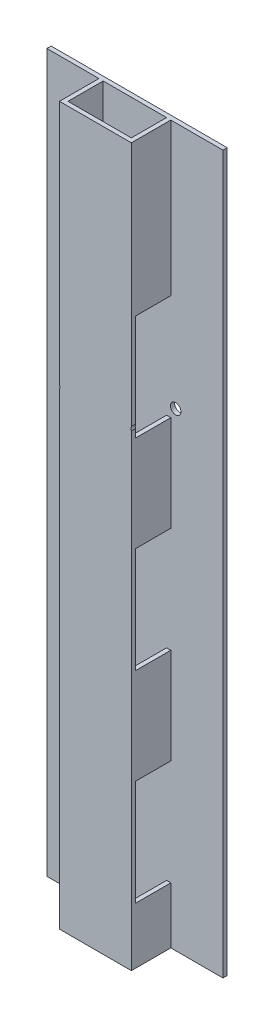
ISO-10303-21;
HEADER;
FILE_DESCRIPTION(('STEP AP214'),'2;1');
FILE_NAME('part.step','',(''),(''),'','','');
FILE_SCHEMA(('AUTOMOTIVE_DESIGN { 1 0 10303 214 1 1 1 1 }'));
ENDSEC;
DATA;
#1=APPLICATION_CONTEXT('core data for automotive mechanical design processes');
#2=APPLICATION_PROTOCOL_DEFINITION('international standard','automotive_design',2000,#1);
#3=PRODUCT_CONTEXT('',#1,'mechanical');
#4=PRODUCT('Part','Part','',(#3));
#5=PRODUCT_RELATED_PRODUCT_CATEGORY('part','',(#4));
#6=PRODUCT_DEFINITION_FORMATION('','',#4);
#7=PRODUCT_DEFINITION_CONTEXT('part definition',#1,'design');
#8=PRODUCT_DEFINITION('design','',#6,#7);
#9=PRODUCT_DEFINITION_SHAPE('','',#8);
#10=(LENGTH_UNIT() NAMED_UNIT(*) SI_UNIT(.MILLI.,.METRE.));
#11=(NAMED_UNIT(*) PLANE_ANGLE_UNIT() SI_UNIT($,.RADIAN.));
#12=(NAMED_UNIT(*) SI_UNIT($,.STERADIAN.) SOLID_ANGLE_UNIT());
#13=UNCERTAINTY_MEASURE_WITH_UNIT(LENGTH_MEASURE(1.E-05),#10,'distance_accuracy_value','');
#14=(GEOMETRIC_REPRESENTATION_CONTEXT(3) GLOBAL_UNCERTAINTY_ASSIGNED_CONTEXT((#13)) GLOBAL_UNIT_ASSIGNED_CONTEXT((#10,
#11,#12)) REPRESENTATION_CONTEXT('',''));
#15=CARTESIAN_POINT('',(0.,0.,0.));
#16=DIRECTION('',(0.,0.,1.));
#17=DIRECTION('',(1.,0.,0.));
#18=AXIS2_PLACEMENT_3D('',#15,#16,#17);
#19=CARTESIAN_POINT('',(25.5,254.5,15.5));
#20=DIRECTION('',(-1.,0.,0.));
#21=DIRECTION('',(0.,0.,1.));
#22=AXIS2_PLACEMENT_3D('',#19,#20,#21);
#23=PLANE('',#22);
#24=DIRECTION('',(0.,0.,1.));
#25=VECTOR('',#24,1.);
#26=CARTESIAN_POINT('',(25.5,77.3474560831854,-15.5));
#27=LINE('',#26,#25);
#28=CARTESIAN_POINT('',(25.5,77.3474560831854,15.5));
#29=VERTEX_POINT('',#28);
#30=CARTESIAN_POINT('',(25.5,77.3474560831854,12.5));
#31=VERTEX_POINT('',#30);
#32=EDGE_CURVE('E46',#29,#31,#27,.F.);
#33=ORIENTED_EDGE('',*,*,#32,.F.);
#34=DIRECTION('',(0.,-1.,0.));
#35=VECTOR('',#34,1.);
#36=CARTESIAN_POINT('',(25.5,254.5,15.5));
#37=LINE('',#36,#35);
#38=CARTESIAN_POINT('',(25.5,-254.5,15.5));
#39=VERTEX_POINT('',#38);
#40=EDGE_CURVE('E302',#29,#39,#37,.T.);
#41=ORIENTED_EDGE('',*,*,#40,.T.);
#42=DIRECTION('',(0.,0.,-1.));
#43=VECTOR('',#42,1.);
#44=CARTESIAN_POINT('',(25.5,-254.5,15.5));
#45=LINE('',#44,#43);
#46=CARTESIAN_POINT('',(25.5,-254.5,-12.5));
#47=VERTEX_POINT('',#46);
#48=EDGE_CURVE('E384',#39,#47,#45,.T.);
#49=ORIENTED_EDGE('',*,*,#48,.T.);
#50=DIRECTION('',(0.,1.,0.));
#51=VECTOR('',#50,1.);
#52=CARTESIAN_POINT('',(25.5,254.5,-12.5));
#53=LINE('',#52,#51);
#54=CARTESIAN_POINT('',(25.5,-214.5,-12.5));
#55=VERTEX_POINT('',#54);
#56=EDGE_CURVE('E347',#47,#55,#53,.T.);
#57=ORIENTED_EDGE('',*,*,#56,.T.);
#58=DIRECTION('',(0.,0.,1.));
#59=VECTOR('',#58,1.);
#60=CARTESIAN_POINT('',(25.5,-214.5,15.5));
#61=LINE('',#60,#59);
#62=CARTESIAN_POINT('',(25.5,-214.5,12.4999999999999));
#63=VERTEX_POINT('',#62);
#64=EDGE_CURVE('E507',#55,#63,#61,.T.);
#65=ORIENTED_EDGE('',*,*,#64,.T.);
#66=DIRECTION('',(0.,1.,0.));
#67=VECTOR('',#66,1.);
#68=CARTESIAN_POINT('',(25.5,254.5,12.4999999999999));
#69=LINE('',#68,#67);
#70=CARTESIAN_POINT('',(25.5,-139.5,12.4999999999999));
#71=VERTEX_POINT('',#70);
#72=EDGE_CURVE('E540',#63,#71,#69,.T.);
#73=ORIENTED_EDGE('',*,*,#72,.T.);
#74=DIRECTION('',(0.,0.,-1.));
#75=VECTOR('',#74,1.);
#76=CARTESIAN_POINT('',(25.5,-139.5,15.5));
#77=LINE('',#76,#75);
#78=CARTESIAN_POINT('',(25.5,-139.5,-12.5));
#79=VERTEX_POINT('',#78);
#80=EDGE_CURVE('E513',#71,#79,#77,.T.);
#81=ORIENTED_EDGE('',*,*,#80,.T.);
#82=CARTESIAN_POINT('',(25.5,-71.5000000000001,-12.5));
#83=VERTEX_POINT('',#82);
#84=EDGE_CURVE('E341',#79,#83,#53,.T.);
#85=ORIENTED_EDGE('',*,*,#84,.T.);
#86=DIRECTION('',(0.,0.,1.));
#87=VECTOR('',#86,1.);
#88=CARTESIAN_POINT('',(25.5,-71.5000000000001,15.5));
#89=LINE('',#88,#87);
#90=CARTESIAN_POINT('',(25.5,-71.5000000000001,12.4999999999999));
#91=VERTEX_POINT('',#90);
#92=EDGE_CURVE('E519',#83,#91,#89,.T.);
#93=ORIENTED_EDGE('',*,*,#92,.T.);
#94=DIRECTION('',(0.,1.,0.));
#95=VECTOR('',#94,1.);
#96=CARTESIAN_POINT('',(25.5,254.5,12.4999999999999));
#97=LINE('',#96,#95);
#98=CARTESIAN_POINT('',(25.5,3.50000000000002,12.4999999999999));
#99=VERTEX_POINT('',#98);
#100=EDGE_CURVE('E543',#91,#99,#97,.T.);
#101=ORIENTED_EDGE('',*,*,#100,.T.);
#102=DIRECTION('',(0.,0.,-1.));
#103=VECTOR('',#102,1.);
#104=CARTESIAN_POINT('',(25.5,3.5,15.5));
#105=LINE('',#104,#103);
#106=CARTESIAN_POINT('',(25.5,3.5,-12.5));
#107=VERTEX_POINT('',#106);
#108=EDGE_CURVE('E525',#99,#107,#105,.T.);
#109=ORIENTED_EDGE('',*,*,#108,.T.);
#110=CARTESIAN_POINT('',(25.5,71.5,-12.5));
#111=VERTEX_POINT('',#110);
#112=EDGE_CURVE('E345',#107,#111,#53,.T.);
#113=ORIENTED_EDGE('',*,*,#112,.T.);
#114=DIRECTION('',(0.,0.,1.));
#115=VECTOR('',#114,1.);
#116=CARTESIAN_POINT('',(25.5,71.5,15.5));
#117=LINE('',#116,#115);
#118=CARTESIAN_POINT('',(25.5,71.5,12.4999999999999));
#119=VERTEX_POINT('',#118);
#120=EDGE_CURVE('E537',#111,#119,#117,.T.);
#121=ORIENTED_EDGE('',*,*,#120,.T.);
#122=DIRECTION('',(0.,1.,0.));
#123=VECTOR('',#122,1.);
#124=CARTESIAN_POINT('',(25.5,254.5,12.4999999999999));
#125=LINE('',#124,#123);
#126=EDGE_CURVE('E547',#119,#31,#125,.T.);
#127=ORIENTED_EDGE('',*,*,#126,.T.);
#128=EDGE_LOOP('',(#33,#41,#49,#57,#65,#73,#81,#85,#93,#101,#109,#113,#121,#127));
#129=FACE_BOUND('',#128,.T.);
#130=ADVANCED_FACE('F32',(#129),#23,.F.);
#131=DIRECTION('',(0.,0.,1.));
#132=VECTOR('',#131,1.);
#133=CARTESIAN_POINT('',(25.5,80.0400384867526,-15.5));
#134=LINE('',#133,#132);
#135=CARTESIAN_POINT('',(25.5,80.0400384867526,12.5));
#136=VERTEX_POINT('',#135);
#137=CARTESIAN_POINT('',(25.5,80.0400384867526,15.5));
#138=VERTEX_POINT('',#137);
#139=EDGE_CURVE('E285',#136,#138,#134,.T.);
#140=ORIENTED_EDGE('',*,*,#139,.F.);
#141=CARTESIAN_POINT('',(25.5,146.5,12.4999999999999));
#142=VERTEX_POINT('',#141);
#143=EDGE_CURVE('E546',#136,#142,#125,.T.);
#144=ORIENTED_EDGE('',*,*,#143,.T.);
#145=DIRECTION('',(0.,0.,-1.));
#146=VECTOR('',#145,1.);
#147=CARTESIAN_POINT('',(25.5,146.5,15.5));
#148=LINE('',#147,#146);
#149=CARTESIAN_POINT('',(25.5,146.5,-12.5));
#150=VERTEX_POINT('',#149);
#151=EDGE_CURVE('E365',#142,#150,#148,.T.);
#152=ORIENTED_EDGE('',*,*,#151,.T.);
#153=CARTESIAN_POINT('',(25.5,254.5,-12.5));
#154=VERTEX_POINT('',#153);
#155=EDGE_CURVE('E317',#150,#154,#53,.T.);
#156=ORIENTED_EDGE('',*,*,#155,.T.);
#157=DIRECTION('',(0.,0.,-1.));
#158=VECTOR('',#157,1.);
#159=CARTESIAN_POINT('',(25.5,254.5,15.5));
#160=LINE('',#159,#158);
#161=CARTESIAN_POINT('',(25.5,254.5,15.5));
#162=VERTEX_POINT('',#161);
#163=EDGE_CURVE('E307',#162,#154,#160,.T.);
#164=ORIENTED_EDGE('',*,*,#163,.F.);
#165=EDGE_CURVE('E299',#162,#138,#37,.T.);
#166=ORIENTED_EDGE('',*,*,#165,.T.);
#167=EDGE_LOOP('',(#140,#144,#152,#156,#164,#166));
#168=FACE_BOUND('',#167,.T.);
#169=ADVANCED_FACE('F304',(#168),#23,.F.);
#170=CARTESIAN_POINT('',(-25.5,254.5,15.5));
#171=DIRECTION('',(1.,0.,0.));
#172=DIRECTION('',(0.,0.,-1.));
#173=AXIS2_PLACEMENT_3D('',#170,#171,#172);
#174=PLANE('',#173);
#175=DIRECTION('',(0.,-1.,0.));
#176=VECTOR('',#175,1.);
#177=CARTESIAN_POINT('',(-25.5,146.5,12.4999999999999));
#178=LINE('',#177,#176);
#179=CARTESIAN_POINT('',(-25.5,146.5,12.4999999999999));
#180=VERTEX_POINT('',#179);
#181=CARTESIAN_POINT('',(-25.5,80.0400384867526,12.5));
#182=VERTEX_POINT('',#181);
#183=EDGE_CURVE('E442',#180,#182,#178,.T.);
#184=ORIENTED_EDGE('',*,*,#183,.T.);
#185=DIRECTION('',(0.,0.,1.));
#186=VECTOR('',#185,1.);
#187=CARTESIAN_POINT('',(-25.5,80.0400384867526,-15.5));
#188=LINE('',#187,#186);
#189=CARTESIAN_POINT('',(-25.5,80.0400384867526,15.5));
#190=VERTEX_POINT('',#189);
#191=EDGE_CURVE('E53',#182,#190,#188,.T.);
#192=ORIENTED_EDGE('',*,*,#191,.T.);
#193=DIRECTION('',(0.,-1.,0.));
#194=VECTOR('',#193,1.);
#195=CARTESIAN_POINT('',(-25.5,254.5,15.5));
#196=LINE('',#195,#194);
#197=CARTESIAN_POINT('',(-25.5,254.5,15.5));
#198=VERTEX_POINT('',#197);
#199=EDGE_CURVE('E310',#198,#190,#196,.T.);
#200=ORIENTED_EDGE('',*,*,#199,.F.);
#201=DIRECTION('',(0.,0.,1.));
#202=VECTOR('',#201,1.);
#203=CARTESIAN_POINT('',(-25.5,254.5,15.5));
#204=LINE('',#203,#202);
#205=CARTESIAN_POINT('',(-25.5,254.5,-12.5));
#206=VERTEX_POINT('',#205);
#207=EDGE_CURVE('E375',#206,#198,#204,.T.);
#208=ORIENTED_EDGE('',*,*,#207,.F.);
#209=DIRECTION('',(0.,-1.,0.));
#210=VECTOR('',#209,1.);
#211=CARTESIAN_POINT('',(-25.5,254.5,-12.5));
#212=LINE('',#211,#210);
#213=CARTESIAN_POINT('',(-25.5,146.5,-12.5));
#214=VERTEX_POINT('',#213);
#215=EDGE_CURVE('E322',#206,#214,#212,.T.);
#216=ORIENTED_EDGE('',*,*,#215,.T.);
#217=DIRECTION('',(0.,0.,1.));
#218=VECTOR('',#217,1.);
#219=CARTESIAN_POINT('',(-25.5,146.5,-12.5));
#220=LINE('',#219,#218);
#221=EDGE_CURVE('E438',#214,#180,#220,.T.);
#222=ORIENTED_EDGE('',*,*,#221,.T.);
#223=EDGE_LOOP('',(#184,#192,#200,#208,#216,#222));
#224=FACE_BOUND('',#223,.T.);
#225=ADVANCED_FACE('F656',(#224),#174,.F.);
#226=CARTESIAN_POINT('',(22.5,254.5,-12.5));
#227=DIRECTION('',(-1.,0.,0.));
#228=DIRECTION('',(0.,0.,1.));
#229=AXIS2_PLACEMENT_3D('',#226,#227,#228);
#230=PLANE('',#229);
#231=DIRECTION('',(0.,0.,1.));
#232=VECTOR('',#231,1.);
#233=CARTESIAN_POINT('',(22.5,71.5,-12.5));
#234=LINE('',#233,#232);
#235=CARTESIAN_POINT('',(22.5,71.5,-12.5));
#236=VERTEX_POINT('',#235);
#237=CARTESIAN_POINT('',(22.5,71.5,12.4999999999999));
#238=VERTEX_POINT('',#237);
#239=EDGE_CURVE('E535',#236,#238,#234,.T.);
#240=ORIENTED_EDGE('',*,*,#239,.F.);
#241=DIRECTION('',(0.,-1.,0.));
#242=VECTOR('',#241,1.);
#243=CARTESIAN_POINT('',(22.5,254.5,-12.5));
#244=LINE('',#243,#242);
#245=CARTESIAN_POINT('',(22.5,3.50000000000002,-12.5000000000001));
#246=VERTEX_POINT('',#245);
#247=EDGE_CURVE('E708',#236,#246,#244,.T.);
#248=ORIENTED_EDGE('',*,*,#247,.T.);
#249=DIRECTION('',(0.,0.,-1.));
#250=VECTOR('',#249,1.);
#251=CARTESIAN_POINT('',(22.5,3.5,-12.5));
#252=LINE('',#251,#250);
#253=CARTESIAN_POINT('',(22.5,3.50000000000002,12.4999999999999));
#254=VERTEX_POINT('',#253);
#255=EDGE_CURVE('E523',#254,#246,#252,.T.);
#256=ORIENTED_EDGE('',*,*,#255,.F.);
#257=DIRECTION('',(0.,-1.,0.));
#258=VECTOR('',#257,1.);
#259=CARTESIAN_POINT('',(22.5,254.5,12.5));
#260=LINE('',#259,#258);
#261=EDGE_CURVE('E576',#238,#254,#260,.T.);
#262=ORIENTED_EDGE('',*,*,#261,.F.);
#263=EDGE_LOOP('',(#240,#248,#256,#262));
#264=FACE_BOUND('',#263,.T.);
#265=ADVANCED_FACE('F660',(#264),#230,.T.);
#266=DIRECTION('',(0.,0.,-1.));
#267=VECTOR('',#266,1.);
#268=CARTESIAN_POINT('',(22.5,146.5,-12.5));
#269=LINE('',#268,#267);
#270=CARTESIAN_POINT('',(22.5,146.5,12.5));
#271=VERTEX_POINT('',#270);
#272=CARTESIAN_POINT('',(22.5,146.5,-12.5));
#273=VERTEX_POINT('',#272);
#274=EDGE_CURVE('E530',#271,#273,#269,.T.);
#275=ORIENTED_EDGE('',*,*,#274,.F.);
#276=CARTESIAN_POINT('',(22.5,254.5,12.5));
#277=VERTEX_POINT('',#276);
#278=EDGE_CURVE('E572',#277,#271,#260,.T.);
#279=ORIENTED_EDGE('',*,*,#278,.F.);
#280=DIRECTION('',(0.,0.,-1.));
#281=VECTOR('',#280,1.);
#282=CARTESIAN_POINT('',(22.5,254.5,-12.5));
#283=LINE('',#282,#281);
#284=CARTESIAN_POINT('',(22.5,254.5,-12.5));
#285=VERTEX_POINT('',#284);
#286=EDGE_CURVE('E551',#277,#285,#283,.T.);
#287=ORIENTED_EDGE('',*,*,#286,.T.);
#288=EDGE_CURVE('E379',#285,#273,#244,.T.);
#289=ORIENTED_EDGE('',*,*,#288,.T.);
#290=EDGE_LOOP('',(#275,#279,#287,#289));
#291=FACE_BOUND('',#290,.T.);
#292=ADVANCED_FACE('F665',(#291),#230,.T.);
#293=DIRECTION('',(0.,0.,1.));
#294=VECTOR('',#293,1.);
#295=CARTESIAN_POINT('',(22.5,-71.5000000000001,-12.5));
#296=LINE('',#295,#294);
#297=CARTESIAN_POINT('',(22.5,-71.5000000000001,-12.5));
#298=VERTEX_POINT('',#297);
#299=CARTESIAN_POINT('',(22.5,-71.5,12.4999999999999));
#300=VERTEX_POINT('',#299);
#301=EDGE_CURVE('E517',#298,#300,#296,.T.);
#302=ORIENTED_EDGE('',*,*,#301,.F.);
#303=CARTESIAN_POINT('',(22.5,-139.5,-12.5000000000001));
#304=VERTEX_POINT('',#303);
#305=EDGE_CURVE('E586',#298,#304,#244,.T.);
#306=ORIENTED_EDGE('',*,*,#305,.T.);
#307=DIRECTION('',(0.,0.,-1.));
#308=VECTOR('',#307,1.);
#309=CARTESIAN_POINT('',(22.5,-139.5,-12.5));
#310=LINE('',#309,#308);
#311=CARTESIAN_POINT('',(22.5,-139.5,12.4999999999999));
#312=VERTEX_POINT('',#311);
#313=EDGE_CURVE('E511',#312,#304,#310,.T.);
#314=ORIENTED_EDGE('',*,*,#313,.F.);
#315=EDGE_CURVE('E1043',#300,#312,#260,.T.);
#316=ORIENTED_EDGE('',*,*,#315,.F.);
#317=EDGE_LOOP('',(#302,#306,#314,#316));
#318=FACE_BOUND('',#317,.T.);
#319=ADVANCED_FACE('F718',(#318),#230,.T.);
#320=CARTESIAN_POINT('',(-22.5,254.5,-12.5));
#321=DIRECTION('',(1.,0.,0.));
#322=DIRECTION('',(0.,0.,-1.));
#323=AXIS2_PLACEMENT_3D('',#320,#321,#322);
#324=PLANE('',#323);
#325=DIRECTION('',(0.,0.,-1.));
#326=VECTOR('',#325,1.);
#327=CARTESIAN_POINT('',(-22.5,71.5,-12.5));
#328=LINE('',#327,#326);
#329=CARTESIAN_POINT('',(-22.5,71.5,12.4999999999999));
#330=VERTEX_POINT('',#329);
#331=CARTESIAN_POINT('',(-22.5,71.5,-12.5));
#332=VERTEX_POINT('',#331);
#333=EDGE_CURVE('E533',#330,#332,#328,.T.);
#334=ORIENTED_EDGE('',*,*,#333,.F.);
#335=DIRECTION('',(0.,-1.,0.));
#336=VECTOR('',#335,1.);
#337=CARTESIAN_POINT('',(-22.5,254.5,12.5));
#338=LINE('',#337,#336);
#339=CARTESIAN_POINT('',(-22.5,3.50000000000002,12.4999999999999));
#340=VERTEX_POINT('',#339);
#341=EDGE_CURVE('E580',#330,#340,#338,.T.);
#342=ORIENTED_EDGE('',*,*,#341,.T.);
#343=DIRECTION('',(0.,0.,1.));
#344=VECTOR('',#343,1.);
#345=CARTESIAN_POINT('',(-22.5,3.5,-12.5));
#346=LINE('',#345,#344);
#347=CARTESIAN_POINT('',(-22.5,3.50000000000002,-12.5000000000001));
#348=VERTEX_POINT('',#347);
#349=EDGE_CURVE('E521',#348,#340,#346,.T.);
#350=ORIENTED_EDGE('',*,*,#349,.F.);
#351=DIRECTION('',(0.,-1.,0.));
#352=VECTOR('',#351,1.);
#353=CARTESIAN_POINT('',(-22.5,254.5,-12.5));
#354=LINE('',#353,#352);
#355=EDGE_CURVE('E584',#332,#348,#354,.T.);
#356=ORIENTED_EDGE('',*,*,#355,.F.);
#357=EDGE_LOOP('',(#334,#342,#350,#356));
#358=FACE_BOUND('',#357,.T.);
#359=ADVANCED_FACE('F627',(#358),#324,.T.);
#360=DIRECTION('',(0.,0.,1.));
#361=VECTOR('',#360,1.);
#362=CARTESIAN_POINT('',(-22.5,146.5,-12.5));
#363=LINE('',#362,#361);
#364=CARTESIAN_POINT('',(-22.5,146.5,-12.5));
#365=VERTEX_POINT('',#364);
#366=CARTESIAN_POINT('',(-22.5,146.5,12.4999999999999));
#367=VERTEX_POINT('',#366);
#368=EDGE_CURVE('E528',#365,#367,#363,.T.);
#369=ORIENTED_EDGE('',*,*,#368,.F.);
#370=CARTESIAN_POINT('',(-22.5,254.5,-12.5));
#371=VERTEX_POINT('',#370);
#372=EDGE_CURVE('E581',#371,#365,#354,.T.);
#373=ORIENTED_EDGE('',*,*,#372,.F.);
#374=DIRECTION('',(0.,0.,1.));
#375=VECTOR('',#374,1.);
#376=CARTESIAN_POINT('',(-22.5,254.5,-12.5));
#377=LINE('',#376,#375);
#378=CARTESIAN_POINT('',(-22.5,254.5,12.5));
#379=VERTEX_POINT('',#378);
#380=EDGE_CURVE('E556',#371,#379,#377,.T.);
#381=ORIENTED_EDGE('',*,*,#380,.T.);
#382=EDGE_CURVE('E577',#379,#367,#338,.T.);
#383=ORIENTED_EDGE('',*,*,#382,.T.);
#384=EDGE_LOOP('',(#369,#373,#381,#383));
#385=FACE_BOUND('',#384,.T.);
#386=ADVANCED_FACE('F695',(#385),#324,.T.);
#387=DIRECTION('',(0.,0.,-1.));
#388=VECTOR('',#387,1.);
#389=CARTESIAN_POINT('',(-22.5,-71.5000000000001,-12.5));
#390=LINE('',#389,#388);
#391=CARTESIAN_POINT('',(-22.5,-71.5000000000001,12.5));
#392=VERTEX_POINT('',#391);
#393=CARTESIAN_POINT('',(-22.5,-71.5,-12.5000000000001));
#394=VERTEX_POINT('',#393);
#395=EDGE_CURVE('E515',#392,#394,#390,.T.);
#396=ORIENTED_EDGE('',*,*,#395,.F.);
#397=CARTESIAN_POINT('',(-22.5,-139.5,12.4999999999999));
#398=VERTEX_POINT('',#397);
#399=EDGE_CURVE('E606',#392,#398,#338,.T.);
#400=ORIENTED_EDGE('',*,*,#399,.T.);
#401=DIRECTION('',(0.,0.,1.));
#402=VECTOR('',#401,1.);
#403=CARTESIAN_POINT('',(-22.5,-139.5,-12.5));
#404=LINE('',#403,#402);
#405=CARTESIAN_POINT('',(-22.5,-139.5,-12.5000000000001));
#406=VERTEX_POINT('',#405);
#407=EDGE_CURVE('E509',#406,#398,#404,.T.);
#408=ORIENTED_EDGE('',*,*,#407,.F.);
#409=EDGE_CURVE('E588',#394,#406,#354,.T.);
#410=ORIENTED_EDGE('',*,*,#409,.F.);
#411=EDGE_LOOP('',(#396,#400,#408,#410));
#412=FACE_BOUND('',#411,.T.);
#413=ADVANCED_FACE('F603',(#412),#324,.T.);
#414=CARTESIAN_POINT('',(0.,254.5,0.));
#415=DIRECTION('',(0.,-1.,0.));
#416=DIRECTION('',(0.,0.,-1.));
#417=AXIS2_PLACEMENT_3D('',#414,#415,#416);
#418=PLANE('',#417);
#419=ORIENTED_EDGE('',*,*,#163,.T.);
#420=DIRECTION('',(1.,0.,0.));
#421=VECTOR('',#420,1.);
#422=CARTESIAN_POINT('',(62.5,254.5,-12.5));
#423=LINE('',#422,#421);
#424=CARTESIAN_POINT('',(62.5,254.5,-12.5));
#425=VERTEX_POINT('',#424);
#426=EDGE_CURVE('E354',#154,#425,#423,.T.);
#427=ORIENTED_EDGE('',*,*,#426,.T.);
#428=DIRECTION('',(0.,0.,-1.));
#429=VECTOR('',#428,1.);
#430=CARTESIAN_POINT('',(62.5,254.5,-12.5));
#431=LINE('',#430,#429);
#432=CARTESIAN_POINT('',(62.5,254.5,-15.5));
#433=VERTEX_POINT('',#432);
#434=EDGE_CURVE('E434',#425,#433,#431,.T.);
#435=ORIENTED_EDGE('',*,*,#434,.T.);
#436=DIRECTION('',(-1.,0.,0.));
#437=VECTOR('',#436,1.);
#438=CARTESIAN_POINT('',(-25.5,254.5,-15.5));
#439=LINE('',#438,#437);
#440=CARTESIAN_POINT('',(-62.5,254.5,-15.5));
#441=VERTEX_POINT('',#440);
#442=EDGE_CURVE('E373',#433,#441,#439,.T.);
#443=ORIENTED_EDGE('',*,*,#442,.T.);
#444=DIRECTION('',(0.,0.,-1.));
#445=VECTOR('',#444,1.);
#446=CARTESIAN_POINT('',(-62.5,254.5,-12.5));
#447=LINE('',#446,#445);
#448=CARTESIAN_POINT('',(-62.5,254.5,-12.5));
#449=VERTEX_POINT('',#448);
#450=EDGE_CURVE('E419',#449,#441,#447,.T.);
#451=ORIENTED_EDGE('',*,*,#450,.F.);
#452=DIRECTION('',(1.,0.,0.));
#453=VECTOR('',#452,1.);
#454=CARTESIAN_POINT('',(-25.5,254.5,-12.5));
#455=LINE('',#454,#453);
#456=EDGE_CURVE('E331',#449,#206,#455,.T.);
#457=ORIENTED_EDGE('',*,*,#456,.T.);
#458=ORIENTED_EDGE('',*,*,#207,.T.);
#459=DIRECTION('',(1.,0.,0.));
#460=VECTOR('',#459,1.);
#461=CARTESIAN_POINT('',(-25.5,254.5,15.5));
#462=LINE('',#461,#460);
#463=EDGE_CURVE('E312',#198,#162,#462,.T.);
#464=ORIENTED_EDGE('',*,*,#463,.T.);
#465=EDGE_LOOP('',(#419,#427,#435,#443,#451,#457,#458,#464));
#466=FACE_BOUND('',#465,.T.);
#467=ORIENTED_EDGE('',*,*,#286,.F.);
#468=DIRECTION('',(1.,0.,0.));
#469=VECTOR('',#468,1.);
#470=CARTESIAN_POINT('',(-22.5,254.5,12.5));
#471=LINE('',#470,#469);
#472=EDGE_CURVE('E559',#379,#277,#471,.T.);
#473=ORIENTED_EDGE('',*,*,#472,.F.);
#474=ORIENTED_EDGE('',*,*,#380,.F.);
#475=DIRECTION('',(-1.,0.,0.));
#476=VECTOR('',#475,1.);
#477=CARTESIAN_POINT('',(-22.5,254.5,-12.5));
#478=LINE('',#477,#476);
#479=EDGE_CURVE('E553',#285,#371,#478,.T.);
#480=ORIENTED_EDGE('',*,*,#479,.F.);
#481=EDGE_LOOP('',(#467,#473,#474,#480));
#482=FACE_BOUND('',#481,.T.);
#483=ADVANCED_FACE('F370',(#466,#482),#418,.F.);
#484=CARTESIAN_POINT('',(0.,-254.5,0.));
#485=DIRECTION('',(0.,-1.,0.));
#486=DIRECTION('',(0.,0.,-1.));
#487=AXIS2_PLACEMENT_3D('',#484,#485,#486);
#488=PLANE('',#487);
#489=ORIENTED_EDGE('',*,*,#48,.F.);
#490=DIRECTION('',(1.,0.,0.));
#491=VECTOR('',#490,1.);
#492=CARTESIAN_POINT('',(-25.5,-254.5,15.5));
#493=LINE('',#492,#491);
#494=CARTESIAN_POINT('',(-25.5,-254.5,15.5));
#495=VERTEX_POINT('',#494);
#496=EDGE_CURVE('E314',#495,#39,#493,.T.);
#497=ORIENTED_EDGE('',*,*,#496,.F.);
#498=DIRECTION('',(0.,0.,1.));
#499=VECTOR('',#498,1.);
#500=CARTESIAN_POINT('',(-25.5,-254.5,15.5));
#501=LINE('',#500,#499);
#502=CARTESIAN_POINT('',(-25.5,-254.5,-12.5));
#503=VERTEX_POINT('',#502);
#504=EDGE_CURVE('E377',#503,#495,#501,.T.);
#505=ORIENTED_EDGE('',*,*,#504,.F.);
#506=DIRECTION('',(-1.,0.,0.));
#507=VECTOR('',#506,1.);
#508=CARTESIAN_POINT('',(-25.5,-254.5,-12.5));
#509=LINE('',#508,#507);
#510=CARTESIAN_POINT('',(-62.5,-254.5,-12.5));
#511=VERTEX_POINT('',#510);
#512=EDGE_CURVE('E330',#503,#511,#509,.T.);
#513=ORIENTED_EDGE('',*,*,#512,.T.);
#514=DIRECTION('',(0.,0.,-1.));
#515=VECTOR('',#514,1.);
#516=CARTESIAN_POINT('',(-62.5,-254.5,-12.5));
#517=LINE('',#516,#515);
#518=CARTESIAN_POINT('',(-62.5,-254.5,-15.5));
#519=VERTEX_POINT('',#518);
#520=EDGE_CURVE('E423',#511,#519,#517,.T.);
#521=ORIENTED_EDGE('',*,*,#520,.T.);
#522=DIRECTION('',(-1.,0.,0.));
#523=VECTOR('',#522,1.);
#524=CARTESIAN_POINT('',(-25.5,-254.5,-15.5));
#525=LINE('',#524,#523);
#526=CARTESIAN_POINT('',(62.5,-254.5,-15.5));
#527=VERTEX_POINT('',#526);
#528=EDGE_CURVE('E386',#527,#519,#525,.T.);
#529=ORIENTED_EDGE('',*,*,#528,.F.);
#530=DIRECTION('',(0.,0.,-1.));
#531=VECTOR('',#530,1.);
#532=CARTESIAN_POINT('',(62.5,-254.5,-12.5));
#533=LINE('',#532,#531);
#534=CARTESIAN_POINT('',(62.5,-254.5,-12.5));
#535=VERTEX_POINT('',#534);
#536=EDGE_CURVE('E360',#535,#527,#533,.T.);
#537=ORIENTED_EDGE('',*,*,#536,.F.);
#538=DIRECTION('',(-1.,0.,0.));
#539=VECTOR('',#538,1.);
#540=CARTESIAN_POINT('',(62.5,-254.5,-12.5));
#541=LINE('',#540,#539);
#542=EDGE_CURVE('E355',#535,#47,#541,.T.);
#543=ORIENTED_EDGE('',*,*,#542,.T.);
#544=EDGE_LOOP('',(#489,#497,#505,#513,#521,#529,#537,#543));
#545=FACE_BOUND('',#544,.T.);
#546=DIRECTION('',(1.,0.,0.));
#547=VECTOR('',#546,1.);
#548=CARTESIAN_POINT('',(-22.5,-254.5,12.5));
#549=LINE('',#548,#547);
#550=CARTESIAN_POINT('',(-22.5,-254.5,12.5));
#551=VERTEX_POINT('',#550);
#552=CARTESIAN_POINT('',(22.5,-254.5,12.5));
#553=VERTEX_POINT('',#552);
#554=EDGE_CURVE('E554',#551,#553,#549,.T.);
#555=ORIENTED_EDGE('',*,*,#554,.T.);
#556=DIRECTION('',(0.,0.,-1.));
#557=VECTOR('',#556,1.);
#558=CARTESIAN_POINT('',(22.5,-254.5,-12.5));
#559=LINE('',#558,#557);
#560=CARTESIAN_POINT('',(22.5,-254.5,-12.5));
#561=VERTEX_POINT('',#560);
#562=EDGE_CURVE('E550',#553,#561,#559,.T.);
#563=ORIENTED_EDGE('',*,*,#562,.T.);
#564=DIRECTION('',(-1.,0.,0.));
#565=VECTOR('',#564,1.);
#566=CARTESIAN_POINT('',(-22.5,-254.5,-12.5));
#567=LINE('',#566,#565);
#568=CARTESIAN_POINT('',(-22.5,-254.5,-12.5));
#569=VERTEX_POINT('',#568);
#570=EDGE_CURVE('E564',#561,#569,#567,.T.);
#571=ORIENTED_EDGE('',*,*,#570,.T.);
#572=DIRECTION('',(0.,0.,1.));
#573=VECTOR('',#572,1.);
#574=CARTESIAN_POINT('',(-22.5,-254.5,-12.5));
#575=LINE('',#574,#573);
#576=EDGE_CURVE('E567',#569,#551,#575,.T.);
#577=ORIENTED_EDGE('',*,*,#576,.T.);
#578=EDGE_LOOP('',(#555,#563,#571,#577));
#579=FACE_BOUND('',#578,.T.);
#580=ADVANCED_FACE('F392',(#545,#579),#488,.T.);
#581=CARTESIAN_POINT('',(-25.5,254.5,-15.5));
#582=DIRECTION('',(0.,0.,1.));
#583=DIRECTION('',(1.,0.,0.));
#584=AXIS2_PLACEMENT_3D('',#581,#582,#583);
#585=PLANE('',#584);
#586=CARTESIAN_POINT('',(29.,78.693747284969,-15.5));
#587=DIRECTION('',(0.,0.,-1.));
#588=DIRECTION('',(-1.,0.,0.));
#589=AXIS2_PLACEMENT_3D('',#586,#587,#588);
#590=CIRCLE('',#589,3.75);
#591=CARTESIAN_POINT('',(25.25,78.693747284969,-15.5));
#592=VERTEX_POINT('',#591);
#593=EDGE_CURVE('E292',#592,#592,#590,.T.);
#594=ORIENTED_EDGE('',*,*,#593,.F.);
#595=EDGE_LOOP('',(#594));
#596=FACE_BOUND('',#595,.T.);
#597=CARTESIAN_POINT('',(-29.,78.693747284969,-15.5));
#598=DIRECTION('',(0.,0.,1.));
#599=DIRECTION('',(1.,0.,0.));
#600=AXIS2_PLACEMENT_3D('',#597,#598,#599);
#601=CIRCLE('',#600,3.75);
#602=CARTESIAN_POINT('',(-25.25,78.693747284969,-15.5));
#603=VERTEX_POINT('',#602);
#604=EDGE_CURVE('E397',#603,#603,#601,.T.);
#605=ORIENTED_EDGE('',*,*,#604,.T.);
#606=EDGE_LOOP('',(#605));
#607=FACE_BOUND('',#606,.T.);
#608=ORIENTED_EDGE('',*,*,#528,.T.);
#609=DIRECTION('',(0.,1.,0.));
#610=VECTOR('',#609,1.);
#611=CARTESIAN_POINT('',(-62.5,-254.5,-15.5));
#612=LINE('',#611,#610);
#613=EDGE_CURVE('E339',#519,#441,#612,.T.);
#614=ORIENTED_EDGE('',*,*,#613,.T.);
#615=ORIENTED_EDGE('',*,*,#442,.F.);
#616=DIRECTION('',(0.,-1.,0.));
#617=VECTOR('',#616,1.);
#618=CARTESIAN_POINT('',(62.5,-254.5,-15.5));
#619=LINE('',#618,#617);
#620=EDGE_CURVE('E422',#433,#527,#619,.T.);
#621=ORIENTED_EDGE('',*,*,#620,.T.);
#622=EDGE_LOOP('',(#608,#614,#615,#621));
#623=FACE_BOUND('',#622,.T.);
#624=ADVANCED_FACE('F670',(#596,#607,#623),#585,.F.);
#625=CARTESIAN_POINT('',(-25.5,77.3474560831854,15.5));
#626=VERTEX_POINT('',#625);
#627=EDGE_CURVE('E308',#626,#495,#196,.T.);
#628=ORIENTED_EDGE('',*,*,#627,.F.);
#629=DIRECTION('',(0.,0.,1.));
#630=VECTOR('',#629,1.);
#631=CARTESIAN_POINT('',(-25.5,77.3474560831854,-15.5));
#632=LINE('',#631,#630);
#633=CARTESIAN_POINT('',(-25.5,77.3474560831854,12.5));
#634=VERTEX_POINT('',#633);
#635=EDGE_CURVE('E401',#626,#634,#632,.F.);
#636=ORIENTED_EDGE('',*,*,#635,.T.);
#637=CARTESIAN_POINT('',(-25.5,71.5,12.4999999999999));
#638=VERTEX_POINT('',#637);
#639=EDGE_CURVE('E440',#634,#638,#178,.T.);
#640=ORIENTED_EDGE('',*,*,#639,.T.);
#641=DIRECTION('',(0.,0.,-1.));
#642=VECTOR('',#641,1.);
#643=CARTESIAN_POINT('',(-25.5,71.5,-12.5));
#644=LINE('',#643,#642);
#645=CARTESIAN_POINT('',(-25.5,71.5,-12.5));
#646=VERTEX_POINT('',#645);
#647=EDGE_CURVE('E445',#638,#646,#644,.T.);
#648=ORIENTED_EDGE('',*,*,#647,.T.);
#649=CARTESIAN_POINT('',(-25.5,3.5,-12.5));
#650=VERTEX_POINT('',#649);
#651=EDGE_CURVE('E318',#646,#650,#212,.T.);
#652=ORIENTED_EDGE('',*,*,#651,.T.);
#653=DIRECTION('',(0.,0.,1.));
#654=VECTOR('',#653,1.);
#655=CARTESIAN_POINT('',(-25.5,3.50000000000002,12.4999999999999));
#656=LINE('',#655,#654);
#657=CARTESIAN_POINT('',(-25.5,3.50000000000002,12.4999999999999));
#658=VERTEX_POINT('',#657);
#659=EDGE_CURVE('E469',#650,#658,#656,.T.);
#660=ORIENTED_EDGE('',*,*,#659,.T.);
#661=DIRECTION('',(0.,-1.,0.));
#662=VECTOR('',#661,1.);
#663=CARTESIAN_POINT('',(-25.5,3.50000000000002,12.4999999999999));
#664=LINE('',#663,#662);
#665=CARTESIAN_POINT('',(-25.5,-71.5,12.4999999999999));
#666=VERTEX_POINT('',#665);
#667=EDGE_CURVE('E462',#658,#666,#664,.T.);
#668=ORIENTED_EDGE('',*,*,#667,.T.);
#669=DIRECTION('',(0.,0.,-1.));
#670=VECTOR('',#669,1.);
#671=CARTESIAN_POINT('',(-25.5,-71.5,12.4999999999999));
#672=LINE('',#671,#670);
#673=CARTESIAN_POINT('',(-25.5,-71.5000000000001,-12.5));
#674=VERTEX_POINT('',#673);
#675=EDGE_CURVE('E465',#666,#674,#672,.T.);
#676=ORIENTED_EDGE('',*,*,#675,.T.);
#677=CARTESIAN_POINT('',(-25.5,-139.5,-12.5));
#678=VERTEX_POINT('',#677);
#679=EDGE_CURVE('E320',#674,#678,#212,.T.);
#680=ORIENTED_EDGE('',*,*,#679,.T.);
#681=DIRECTION('',(0.,0.,1.));
#682=VECTOR('',#681,1.);
#683=CARTESIAN_POINT('',(-25.5,-139.5,12.4999999999999));
#684=LINE('',#683,#682);
#685=CARTESIAN_POINT('',(-25.5,-139.5,12.4999999999999));
#686=VERTEX_POINT('',#685);
#687=EDGE_CURVE('E488',#678,#686,#684,.T.);
#688=ORIENTED_EDGE('',*,*,#687,.T.);
#689=DIRECTION('',(0.,-1.,0.));
#690=VECTOR('',#689,1.);
#691=CARTESIAN_POINT('',(-25.5,-139.5,12.4999999999999));
#692=LINE('',#691,#690);
#693=CARTESIAN_POINT('',(-25.5,-214.5,12.4999999999999));
#694=VERTEX_POINT('',#693);
#695=EDGE_CURVE('E436',#686,#694,#692,.T.);
#696=ORIENTED_EDGE('',*,*,#695,.T.);
#697=DIRECTION('',(0.,0.,-1.));
#698=VECTOR('',#697,1.);
#699=CARTESIAN_POINT('',(-25.5,-214.5,12.4999999999999));
#700=LINE('',#699,#698);
#701=CARTESIAN_POINT('',(-25.5,-214.5,-12.5));
#702=VERTEX_POINT('',#701);
#703=EDGE_CURVE('E486',#694,#702,#700,.T.);
#704=ORIENTED_EDGE('',*,*,#703,.T.);
#705=EDGE_CURVE('E327',#702,#503,#212,.T.);
#706=ORIENTED_EDGE('',*,*,#705,.T.);
#707=ORIENTED_EDGE('',*,*,#504,.T.);
#708=EDGE_LOOP('',(#628,#636,#640,#648,#652,#660,#668,#676,#680,#688,#696,#704,#706,#707));
#709=FACE_BOUND('',#708,.T.);
#710=ADVANCED_FACE('F389',(#709),#174,.F.);
#711=CARTESIAN_POINT('',(-25.5,254.5,15.5));
#712=DIRECTION('',(0.,0.,-1.));
#713=DIRECTION('',(-1.,0.,0.));
#714=AXIS2_PLACEMENT_3D('',#711,#712,#713);
#715=PLANE('',#714);
#716=CARTESIAN_POINT('',(29.,78.693747284969,15.5));
#717=DIRECTION('',(0.,0.,-1.));
#718=DIRECTION('',(-1.,0.,0.));
#719=AXIS2_PLACEMENT_3D('',#716,#717,#718);
#720=CIRCLE('',#719,3.75);
#721=EDGE_CURVE('E288',#29,#138,#720,.T.);
#722=ORIENTED_EDGE('',*,*,#721,.T.);
#723=ORIENTED_EDGE('',*,*,#165,.F.);
#724=ORIENTED_EDGE('',*,*,#463,.F.);
#725=ORIENTED_EDGE('',*,*,#199,.T.);
#726=CARTESIAN_POINT('',(-29.,78.693747284969,15.5));
#727=DIRECTION('',(0.,0.,1.));
#728=DIRECTION('',(1.,0.,0.));
#729=AXIS2_PLACEMENT_3D('',#726,#727,#728);
#730=CIRCLE('',#729,3.75);
#731=EDGE_CURVE('E395',#626,#190,#730,.T.);
#732=ORIENTED_EDGE('',*,*,#731,.F.);
#733=ORIENTED_EDGE('',*,*,#627,.T.);
#734=ORIENTED_EDGE('',*,*,#496,.T.);
#735=ORIENTED_EDGE('',*,*,#40,.F.);
#736=EDGE_LOOP('',(#722,#723,#724,#725,#732,#733,#734,#735));
#737=FACE_BOUND('',#736,.T.);
#738=ADVANCED_FACE('F297',(#737),#715,.F.);
#739=DIRECTION('',(0.,0.,1.));
#740=VECTOR('',#739,1.);
#741=CARTESIAN_POINT('',(22.5,-214.5,-12.5));
#742=LINE('',#741,#740);
#743=CARTESIAN_POINT('',(22.5,-214.5,-12.5));
#744=VERTEX_POINT('',#743);
#745=CARTESIAN_POINT('',(22.5,-214.5,12.4999999999999));
#746=VERTEX_POINT('',#745);
#747=EDGE_CURVE('E505',#744,#746,#742,.T.);
#748=ORIENTED_EDGE('',*,*,#747,.F.);
#749=EDGE_CURVE('E583',#744,#561,#244,.T.);
#750=ORIENTED_EDGE('',*,*,#749,.T.);
#751=ORIENTED_EDGE('',*,*,#562,.F.);
#752=EDGE_CURVE('E561',#746,#553,#260,.T.);
#753=ORIENTED_EDGE('',*,*,#752,.F.);
#754=EDGE_LOOP('',(#748,#750,#751,#753));
#755=FACE_BOUND('',#754,.T.);
#756=ADVANCED_FACE('F646',(#755),#230,.T.);
#757=CARTESIAN_POINT('',(-22.5,254.5,-12.5));
#758=DIRECTION('',(0.,0.,1.));
#759=DIRECTION('',(1.,0.,0.));
#760=AXIS2_PLACEMENT_3D('',#757,#758,#759);
#761=PLANE('',#760);
#762=CARTESIAN_POINT('',(29.,78.693747284969,-12.5));
#763=DIRECTION('',(0.,0.,1.));
#764=DIRECTION('',(1.,0.,0.));
#765=AXIS2_PLACEMENT_3D('',#762,#763,#764);
#766=CIRCLE('',#765,3.75);
#767=CARTESIAN_POINT('',(32.75,78.693747284969,-12.5));
#768=VERTEX_POINT('',#767);
#769=EDGE_CURVE('E398',#768,#768,#766,.F.);
#770=ORIENTED_EDGE('',*,*,#769,.T.);
#771=EDGE_LOOP('',(#770));
#772=FACE_BOUND('',#771,.T.);
#773=CARTESIAN_POINT('',(-29.,78.693747284969,-12.5));
#774=DIRECTION('',(0.,0.,1.));
#775=DIRECTION('',(1.,0.,0.));
#776=AXIS2_PLACEMENT_3D('',#773,#774,#775);
#777=CIRCLE('',#776,3.75);
#778=CARTESIAN_POINT('',(-25.25,78.693747284969,-12.5));
#779=VERTEX_POINT('',#778);
#780=EDGE_CURVE('E409',#779,#779,#777,.T.);
#781=ORIENTED_EDGE('',*,*,#780,.F.);
#782=EDGE_LOOP('',(#781));
#783=FACE_BOUND('',#782,.T.);
#784=DIRECTION('',(1.,0.,0.));
#785=VECTOR('',#784,1.);
#786=CARTESIAN_POINT('',(-25.5,146.5,-12.5));
#787=LINE('',#786,#785);
#788=EDGE_CURVE('E460',#214,#365,#787,.T.);
#789=ORIENTED_EDGE('',*,*,#788,.F.);
#790=ORIENTED_EDGE('',*,*,#215,.F.);
#791=ORIENTED_EDGE('',*,*,#456,.F.);
#792=DIRECTION('',(0.,1.,0.));
#793=VECTOR('',#792,1.);
#794=CARTESIAN_POINT('',(-62.5,-254.5,-12.5));
#795=LINE('',#794,#793);
#796=EDGE_CURVE('E337',#511,#449,#795,.T.);
#797=ORIENTED_EDGE('',*,*,#796,.F.);
#798=ORIENTED_EDGE('',*,*,#512,.F.);
#799=ORIENTED_EDGE('',*,*,#705,.F.);
#800=DIRECTION('',(1.,0.,0.));
#801=VECTOR('',#800,1.);
#802=CARTESIAN_POINT('',(-25.5,-214.5,-12.5000000000001));
#803=LINE('',#802,#801);
#804=CARTESIAN_POINT('',(-22.5,-214.5,-12.5000000000001));
#805=VERTEX_POINT('',#804);
#806=EDGE_CURVE('E498',#702,#805,#803,.T.);
#807=ORIENTED_EDGE('',*,*,#806,.T.);
#808=EDGE_CURVE('E579',#805,#569,#354,.T.);
#809=ORIENTED_EDGE('',*,*,#808,.T.);
#810=ORIENTED_EDGE('',*,*,#570,.F.);
#811=ORIENTED_EDGE('',*,*,#749,.F.);
#812=EDGE_CURVE('E501',#744,#55,#803,.T.);
#813=ORIENTED_EDGE('',*,*,#812,.T.);
#814=ORIENTED_EDGE('',*,*,#56,.F.);
#815=ORIENTED_EDGE('',*,*,#542,.F.);
#816=DIRECTION('',(0.,-1.,0.));
#817=VECTOR('',#816,1.);
#818=CARTESIAN_POINT('',(62.5,-254.5,-12.5));
#819=LINE('',#818,#817);
#820=EDGE_CURVE('E362',#425,#535,#819,.T.);
#821=ORIENTED_EDGE('',*,*,#820,.F.);
#822=ORIENTED_EDGE('',*,*,#426,.F.);
#823=ORIENTED_EDGE('',*,*,#155,.F.);
#824=EDGE_CURVE('E447',#273,#150,#787,.T.);
#825=ORIENTED_EDGE('',*,*,#824,.F.);
#826=ORIENTED_EDGE('',*,*,#288,.F.);
#827=ORIENTED_EDGE('',*,*,#479,.T.);
#828=ORIENTED_EDGE('',*,*,#372,.T.);
#829=EDGE_LOOP('',(#789,#790,#791,#797,#798,#799,#807,#809,#810,#811,#813,#814,#815,#821,#822,
#823,#825,#826,#827,#828));
#830=FACE_BOUND('',#829,.T.);
#831=DIRECTION('',(1.,0.,0.));
#832=VECTOR('',#831,1.);
#833=CARTESIAN_POINT('',(-25.5,3.50000000000002,-12.5000000000001));
#834=LINE('',#833,#832);
#835=EDGE_CURVE('E475',#650,#348,#834,.T.);
#836=ORIENTED_EDGE('',*,*,#835,.F.);
#837=ORIENTED_EDGE('',*,*,#651,.F.);
#838=DIRECTION('',(1.,0.,0.));
#839=VECTOR('',#838,1.);
#840=CARTESIAN_POINT('',(-25.5,71.5,-12.5));
#841=LINE('',#840,#839);
#842=EDGE_CURVE('E448',#646,#332,#841,.T.);
#843=ORIENTED_EDGE('',*,*,#842,.T.);
#844=ORIENTED_EDGE('',*,*,#355,.T.);
#845=EDGE_LOOP('',(#836,#837,#843,#844));
#846=FACE_BOUND('',#845,.T.);
#847=ORIENTED_EDGE('',*,*,#679,.F.);
#848=DIRECTION('',(1.,0.,0.));
#849=VECTOR('',#848,1.);
#850=CARTESIAN_POINT('',(-25.5,-71.5,-12.5000000000001));
#851=LINE('',#850,#849);
#852=EDGE_CURVE('E478',#674,#394,#851,.T.);
#853=ORIENTED_EDGE('',*,*,#852,.T.);
#854=ORIENTED_EDGE('',*,*,#409,.T.);
#855=DIRECTION('',(1.,0.,0.));
#856=VECTOR('',#855,1.);
#857=CARTESIAN_POINT('',(-25.5,-139.5,-12.5000000000001));
#858=LINE('',#857,#856);
#859=EDGE_CURVE('E495',#678,#406,#858,.T.);
#860=ORIENTED_EDGE('',*,*,#859,.F.);
#861=EDGE_LOOP('',(#847,#853,#854,#860));
#862=FACE_BOUND('',#861,.T.);
#863=EDGE_CURVE('E481',#298,#83,#851,.T.);
#864=ORIENTED_EDGE('',*,*,#863,.T.);
#865=ORIENTED_EDGE('',*,*,#84,.F.);
#866=EDGE_CURVE('E497',#304,#79,#858,.T.);
#867=ORIENTED_EDGE('',*,*,#866,.F.);
#868=ORIENTED_EDGE('',*,*,#305,.F.);
#869=EDGE_LOOP('',(#864,#865,#867,#868));
#870=FACE_BOUND('',#869,.T.);
#871=ORIENTED_EDGE('',*,*,#112,.F.);
#872=EDGE_CURVE('E477',#246,#107,#834,.T.);
#873=ORIENTED_EDGE('',*,*,#872,.F.);
#874=ORIENTED_EDGE('',*,*,#247,.F.);
#875=EDGE_CURVE('E452',#236,#111,#841,.T.);
#876=ORIENTED_EDGE('',*,*,#875,.T.);
#877=EDGE_LOOP('',(#871,#873,#874,#876));
#878=FACE_BOUND('',#877,.T.);
#879=ADVANCED_FACE('F596',(#772,#783,#830,#846,#862,#870,#878),#761,.T.);
#880=DIRECTION('',(0.,0.,-1.));
#881=VECTOR('',#880,1.);
#882=CARTESIAN_POINT('',(-22.5,-214.5,-12.5));
#883=LINE('',#882,#881);
#884=CARTESIAN_POINT('',(-22.5,-214.5,12.5));
#885=VERTEX_POINT('',#884);
#886=EDGE_CURVE('E451',#885,#805,#883,.T.);
#887=ORIENTED_EDGE('',*,*,#886,.F.);
#888=EDGE_CURVE('E575',#885,#551,#338,.T.);
#889=ORIENTED_EDGE('',*,*,#888,.T.);
#890=ORIENTED_EDGE('',*,*,#576,.F.);
#891=ORIENTED_EDGE('',*,*,#808,.F.);
#892=EDGE_LOOP('',(#887,#889,#890,#891));
#893=FACE_BOUND('',#892,.T.);
#894=ADVANCED_FACE('F638',(#893),#324,.T.);
#895=CARTESIAN_POINT('',(-22.5,254.5,12.5));
#896=DIRECTION('',(0.,0.,-1.));
#897=DIRECTION('',(-1.,0.,0.));
#898=AXIS2_PLACEMENT_3D('',#895,#896,#897);
#899=PLANE('',#898);
#900=ORIENTED_EDGE('',*,*,#143,.F.);
#901=CARTESIAN_POINT('',(29.,78.693747284969,12.5));
#902=DIRECTION('',(0.,0.,-1.));
#903=DIRECTION('',(-1.,0.,0.));
#904=AXIS2_PLACEMENT_3D('',#901,#902,#903);
#905=CIRCLE('',#904,3.75);
#906=EDGE_CURVE('E11',#136,#31,#905,.F.);
#907=ORIENTED_EDGE('',*,*,#906,.T.);
#908=ORIENTED_EDGE('',*,*,#126,.F.);
#909=DIRECTION('',(1.,0.,0.));
#910=VECTOR('',#909,1.);
#911=CARTESIAN_POINT('',(-25.5,71.5,12.4999999999999));
#912=LINE('',#911,#910);
#913=EDGE_CURVE('E455',#238,#119,#912,.T.);
#914=ORIENTED_EDGE('',*,*,#913,.F.);
#915=ORIENTED_EDGE('',*,*,#261,.T.);
#916=DIRECTION('',(1.,0.,0.));
#917=VECTOR('',#916,1.);
#918=CARTESIAN_POINT('',(-25.5,3.50000000000002,12.4999999999999));
#919=LINE('',#918,#917);
#920=EDGE_CURVE('E474',#254,#99,#919,.T.);
#921=ORIENTED_EDGE('',*,*,#920,.T.);
#922=ORIENTED_EDGE('',*,*,#100,.F.);
#923=DIRECTION('',(1.,0.,0.));
#924=VECTOR('',#923,1.);
#925=CARTESIAN_POINT('',(-25.5,-71.5,12.4999999999999));
#926=LINE('',#925,#924);
#927=EDGE_CURVE('E471',#300,#91,#926,.T.);
#928=ORIENTED_EDGE('',*,*,#927,.F.);
#929=ORIENTED_EDGE('',*,*,#315,.T.);
#930=DIRECTION('',(1.,0.,0.));
#931=VECTOR('',#930,1.);
#932=CARTESIAN_POINT('',(-25.5,-139.5,12.4999999999999));
#933=LINE('',#932,#931);
#934=EDGE_CURVE('E494',#312,#71,#933,.T.);
#935=ORIENTED_EDGE('',*,*,#934,.T.);
#936=ORIENTED_EDGE('',*,*,#72,.F.);
#937=DIRECTION('',(1.,0.,0.));
#938=VECTOR('',#937,1.);
#939=CARTESIAN_POINT('',(-25.5,-214.5,12.4999999999999));
#940=LINE('',#939,#938);
#941=EDGE_CURVE('E491',#746,#63,#940,.T.);
#942=ORIENTED_EDGE('',*,*,#941,.F.);
#943=ORIENTED_EDGE('',*,*,#752,.T.);
#944=ORIENTED_EDGE('',*,*,#554,.F.);
#945=ORIENTED_EDGE('',*,*,#888,.F.);
#946=EDGE_CURVE('E502',#694,#885,#940,.T.);
#947=ORIENTED_EDGE('',*,*,#946,.F.);
#948=ORIENTED_EDGE('',*,*,#695,.F.);
#949=EDGE_CURVE('E466',#686,#398,#933,.T.);
#950=ORIENTED_EDGE('',*,*,#949,.T.);
#951=ORIENTED_EDGE('',*,*,#399,.F.);
#952=EDGE_CURVE('E482',#666,#392,#926,.T.);
#953=ORIENTED_EDGE('',*,*,#952,.F.);
#954=ORIENTED_EDGE('',*,*,#667,.F.);
#955=EDGE_CURVE('E441',#658,#340,#919,.T.);
#956=ORIENTED_EDGE('',*,*,#955,.T.);
#957=ORIENTED_EDGE('',*,*,#341,.F.);
#958=EDGE_CURVE('E453',#638,#330,#912,.T.);
#959=ORIENTED_EDGE('',*,*,#958,.F.);
#960=ORIENTED_EDGE('',*,*,#639,.F.);
#961=CARTESIAN_POINT('',(-29.,78.693747284969,12.5));
#962=DIRECTION('',(0.,0.,-1.));
#963=DIRECTION('',(-1.,0.,0.));
#964=AXIS2_PLACEMENT_3D('',#961,#962,#963);
#965=CIRCLE('',#964,3.75);
#966=EDGE_CURVE('E39',#182,#634,#965,.T.);
#967=ORIENTED_EDGE('',*,*,#966,.F.);
#968=ORIENTED_EDGE('',*,*,#183,.F.);
#969=DIRECTION('',(1.,0.,0.));
#970=VECTOR('',#969,1.);
#971=CARTESIAN_POINT('',(-25.5,146.5,12.4999999999999));
#972=LINE('',#971,#970);
#973=EDGE_CURVE('E456',#180,#367,#972,.T.);
#974=ORIENTED_EDGE('',*,*,#973,.T.);
#975=ORIENTED_EDGE('',*,*,#382,.F.);
#976=ORIENTED_EDGE('',*,*,#472,.T.);
#977=ORIENTED_EDGE('',*,*,#278,.T.);
#978=EDGE_CURVE('E459',#271,#142,#972,.T.);
#979=ORIENTED_EDGE('',*,*,#978,.T.);
#980=EDGE_LOOP('',(#900,#907,#908,#914,#915,#921,#922,#928,#929,#935,#936,#942,#943,#944,#945,
#947,#948,#950,#951,#953,#954,#956,#957,#959,#960,#967,#968,#974,#975,#976,#977,#979));
#981=FACE_BOUND('',#980,.T.);
#982=ADVANCED_FACE('F611',(#981),#899,.T.);
#983=CARTESIAN_POINT('',(-25.5,-214.5,12.4999999999999));
#984=DIRECTION('',(0.,-1.,0.));
#985=DIRECTION('',(0.,0.,-1.));
#986=AXIS2_PLACEMENT_3D('',#983,#984,#985);
#987=PLANE('',#986);
#988=ORIENTED_EDGE('',*,*,#886,.T.);
#989=ORIENTED_EDGE('',*,*,#806,.F.);
#990=ORIENTED_EDGE('',*,*,#703,.F.);
#991=ORIENTED_EDGE('',*,*,#946,.T.);
#992=EDGE_LOOP('',(#988,#989,#990,#991));
#993=FACE_BOUND('',#992,.T.);
#994=ADVANCED_FACE('F734',(#993),#987,.F.);
#995=CARTESIAN_POINT('',(-25.5,-139.5,12.4999999999999));
#996=DIRECTION('',(0.,1.,0.));
#997=DIRECTION('',(0.,0.,1.));
#998=AXIS2_PLACEMENT_3D('',#995,#996,#997);
#999=PLANE('',#998);
#1000=ORIENTED_EDGE('',*,*,#407,.T.);
#1001=ORIENTED_EDGE('',*,*,#949,.F.);
#1002=ORIENTED_EDGE('',*,*,#687,.F.);
#1003=ORIENTED_EDGE('',*,*,#859,.T.);
#1004=EDGE_LOOP('',(#1000,#1001,#1002,#1003));
#1005=FACE_BOUND('',#1004,.T.);
#1006=ADVANCED_FACE('F608',(#1005),#999,.F.);
#1007=CARTESIAN_POINT('',(-25.5,-71.5,12.4999999999999));
#1008=DIRECTION('',(0.,-1.,0.));
#1009=DIRECTION('',(0.,0.,-1.));
#1010=AXIS2_PLACEMENT_3D('',#1007,#1008,#1009);
#1011=PLANE('',#1010);
#1012=ORIENTED_EDGE('',*,*,#395,.T.);
#1013=ORIENTED_EDGE('',*,*,#852,.F.);
#1014=ORIENTED_EDGE('',*,*,#675,.F.);
#1015=ORIENTED_EDGE('',*,*,#952,.T.);
#1016=EDGE_LOOP('',(#1012,#1013,#1014,#1015));
#1017=FACE_BOUND('',#1016,.T.);
#1018=ADVANCED_FACE('F616',(#1017),#1011,.F.);
#1019=CARTESIAN_POINT('',(-25.5,3.50000000000002,12.4999999999999));
#1020=DIRECTION('',(0.,1.,0.));
#1021=DIRECTION('',(0.,0.,1.));
#1022=AXIS2_PLACEMENT_3D('',#1019,#1020,#1021);
#1023=PLANE('',#1022);
#1024=ORIENTED_EDGE('',*,*,#349,.T.);
#1025=ORIENTED_EDGE('',*,*,#955,.F.);
#1026=ORIENTED_EDGE('',*,*,#659,.F.);
#1027=ORIENTED_EDGE('',*,*,#835,.T.);
#1028=EDGE_LOOP('',(#1024,#1025,#1026,#1027));
#1029=FACE_BOUND('',#1028,.T.);
#1030=ADVANCED_FACE('F622',(#1029),#1023,.F.);
#1031=CARTESIAN_POINT('',(-25.5,146.5,-12.5));
#1032=DIRECTION('',(0.,1.,0.));
#1033=DIRECTION('',(0.,0.,1.));
#1034=AXIS2_PLACEMENT_3D('',#1031,#1032,#1033);
#1035=PLANE('',#1034);
#1036=ORIENTED_EDGE('',*,*,#368,.T.);
#1037=ORIENTED_EDGE('',*,*,#973,.F.);
#1038=ORIENTED_EDGE('',*,*,#221,.F.);
#1039=ORIENTED_EDGE('',*,*,#788,.T.);
#1040=EDGE_LOOP('',(#1036,#1037,#1038,#1039));
#1041=FACE_BOUND('',#1040,.T.);
#1042=ADVANCED_FACE('F693',(#1041),#1035,.F.);
#1043=CARTESIAN_POINT('',(-25.5,71.5,-12.5));
#1044=DIRECTION('',(0.,-1.,0.));
#1045=DIRECTION('',(0.,0.,-1.));
#1046=AXIS2_PLACEMENT_3D('',#1043,#1044,#1045);
#1047=PLANE('',#1046);
#1048=ORIENTED_EDGE('',*,*,#333,.T.);
#1049=ORIENTED_EDGE('',*,*,#842,.F.);
#1050=ORIENTED_EDGE('',*,*,#647,.F.);
#1051=ORIENTED_EDGE('',*,*,#958,.T.);
#1052=EDGE_LOOP('',(#1048,#1049,#1050,#1051));
#1053=FACE_BOUND('',#1052,.T.);
#1054=ADVANCED_FACE('F632',(#1053),#1047,.F.);
#1055=ORIENTED_EDGE('',*,*,#934,.F.);
#1056=ORIENTED_EDGE('',*,*,#313,.T.);
#1057=ORIENTED_EDGE('',*,*,#866,.T.);
#1058=ORIENTED_EDGE('',*,*,#80,.F.);
#1059=EDGE_LOOP('',(#1055,#1056,#1057,#1058));
#1060=FACE_BOUND('',#1059,.T.);
#1061=ADVANCED_FACE('F725',(#1060),#999,.F.);
#1062=ORIENTED_EDGE('',*,*,#812,.F.);
#1063=ORIENTED_EDGE('',*,*,#747,.T.);
#1064=ORIENTED_EDGE('',*,*,#941,.T.);
#1065=ORIENTED_EDGE('',*,*,#64,.F.);
#1066=EDGE_LOOP('',(#1062,#1063,#1064,#1065));
#1067=FACE_BOUND('',#1066,.T.);
#1068=ADVANCED_FACE('F648',(#1067),#987,.F.);
#1069=ORIENTED_EDGE('',*,*,#920,.F.);
#1070=ORIENTED_EDGE('',*,*,#255,.T.);
#1071=ORIENTED_EDGE('',*,*,#872,.T.);
#1072=ORIENTED_EDGE('',*,*,#108,.F.);
#1073=EDGE_LOOP('',(#1069,#1070,#1071,#1072));
#1074=FACE_BOUND('',#1073,.T.);
#1075=ADVANCED_FACE('F732',(#1074),#1023,.F.);
#1076=ORIENTED_EDGE('',*,*,#863,.F.);
#1077=ORIENTED_EDGE('',*,*,#301,.T.);
#1078=ORIENTED_EDGE('',*,*,#927,.T.);
#1079=ORIENTED_EDGE('',*,*,#92,.F.);
#1080=EDGE_LOOP('',(#1076,#1077,#1078,#1079));
#1081=FACE_BOUND('',#1080,.T.);
#1082=ADVANCED_FACE('F743',(#1081),#1011,.F.);
#1083=ORIENTED_EDGE('',*,*,#875,.F.);
#1084=ORIENTED_EDGE('',*,*,#239,.T.);
#1085=ORIENTED_EDGE('',*,*,#913,.T.);
#1086=ORIENTED_EDGE('',*,*,#120,.F.);
#1087=EDGE_LOOP('',(#1083,#1084,#1085,#1086));
#1088=FACE_BOUND('',#1087,.T.);
#1089=ADVANCED_FACE('F736',(#1088),#1047,.F.);
#1090=ORIENTED_EDGE('',*,*,#978,.F.);
#1091=ORIENTED_EDGE('',*,*,#274,.T.);
#1092=ORIENTED_EDGE('',*,*,#824,.T.);
#1093=ORIENTED_EDGE('',*,*,#151,.F.);
#1094=EDGE_LOOP('',(#1090,#1091,#1092,#1093));
#1095=FACE_BOUND('',#1094,.T.);
#1096=ADVANCED_FACE('F707',(#1095),#1035,.F.);
#1097=CARTESIAN_POINT('',(62.5,-254.5,-12.5));
#1098=DIRECTION('',(1.,0.,0.));
#1099=DIRECTION('',(0.,0.,-1.));
#1100=AXIS2_PLACEMENT_3D('',#1097,#1098,#1099);
#1101=PLANE('',#1100);
#1102=ORIENTED_EDGE('',*,*,#620,.F.);
#1103=ORIENTED_EDGE('',*,*,#434,.F.);
#1104=ORIENTED_EDGE('',*,*,#820,.T.);
#1105=ORIENTED_EDGE('',*,*,#536,.T.);
#1106=EDGE_LOOP('',(#1102,#1103,#1104,#1105));
#1107=FACE_BOUND('',#1106,.T.);
#1108=ADVANCED_FACE('F890',(#1107),#1101,.T.);
#1109=CARTESIAN_POINT('',(-62.5,-254.5,-12.5));
#1110=DIRECTION('',(-1.,0.,0.));
#1111=DIRECTION('',(0.,0.,1.));
#1112=AXIS2_PLACEMENT_3D('',#1109,#1110,#1111);
#1113=PLANE('',#1112);
#1114=ORIENTED_EDGE('',*,*,#613,.F.);
#1115=ORIENTED_EDGE('',*,*,#520,.F.);
#1116=ORIENTED_EDGE('',*,*,#796,.T.);
#1117=ORIENTED_EDGE('',*,*,#450,.T.);
#1118=EDGE_LOOP('',(#1114,#1115,#1116,#1117));
#1119=FACE_BOUND('',#1118,.T.);
#1120=ADVANCED_FACE('F687',(#1119),#1113,.T.);
#1121=CARTESIAN_POINT('',(-29.,78.693747284969,-15.5));
#1122=DIRECTION('',(0.,0.,1.));
#1123=DIRECTION('',(1.,0.,0.));
#1124=AXIS2_PLACEMENT_3D('',#1121,#1122,#1123);
#1125=CYLINDRICAL_SURFACE('',#1124,3.75);
#1126=ORIENTED_EDGE('',*,*,#966,.T.);
#1127=ORIENTED_EDGE('',*,*,#635,.F.);
#1128=ORIENTED_EDGE('',*,*,#731,.T.);
#1129=ORIENTED_EDGE('',*,*,#191,.F.);
#1130=EDGE_LOOP('',(#1126,#1127,#1128,#1129));
#1131=FACE_BOUND('',#1130,.T.);
#1132=ADVANCED_FACE('F971',(#1131),#1125,.F.);
#1133=ORIENTED_EDGE('',*,*,#780,.T.);
#1134=EDGE_LOOP('',(#1133));
#1135=FACE_BOUND('',#1134,.T.);
#1136=ORIENTED_EDGE('',*,*,#604,.F.);
#1137=EDGE_LOOP('',(#1136));
#1138=FACE_BOUND('',#1137,.T.);
#1139=ADVANCED_FACE('F983',(#1135,#1138),#1125,.F.);
#1140=CARTESIAN_POINT('',(29.,78.693747284969,-15.5));
#1141=DIRECTION('',(0.,0.,1.));
#1142=DIRECTION('',(1.,0.,0.));
#1143=AXIS2_PLACEMENT_3D('',#1140,#1141,#1142);
#1144=CYLINDRICAL_SURFACE('',#1143,3.75);
#1145=ORIENTED_EDGE('',*,*,#32,.T.);
#1146=ORIENTED_EDGE('',*,*,#906,.F.);
#1147=ORIENTED_EDGE('',*,*,#139,.T.);
#1148=ORIENTED_EDGE('',*,*,#721,.F.);
#1149=EDGE_LOOP('',(#1145,#1146,#1147,#1148));
#1150=FACE_BOUND('',#1149,.T.);
#1151=ADVANCED_FACE('F287',(#1150),#1144,.F.);
#1152=ORIENTED_EDGE('',*,*,#769,.F.);
#1153=EDGE_LOOP('',(#1152));
#1154=FACE_BOUND('',#1153,.T.);
#1155=ORIENTED_EDGE('',*,*,#593,.T.);
#1156=EDGE_LOOP('',(#1155));
#1157=FACE_BOUND('',#1156,.T.);
#1158=ADVANCED_FACE('F1002',(#1154,#1157),#1144,.F.);
#1159=CLOSED_SHELL('',(#130,#169,#225,#265,#292,#319,#359,#386,#413,#483,#580,#624,#710,#738,
#756,#879,#894,#982,#994,#1006,#1018,#1030,#1042,#1054,#1061,#1068,#1075,#1082,#1089,#1096,
#1108,#1120,#1132,#1139,#1151,#1158));
#1160=MANIFOLD_SOLID_BREP('B2',#1159);
#1161=ADVANCED_BREP_SHAPE_REPRESENTATION('',(#18,#1160),#14);
#1162=SHAPE_DEFINITION_REPRESENTATION(#9,#1161);
ENDSEC;
END-ISO-10303-21;
